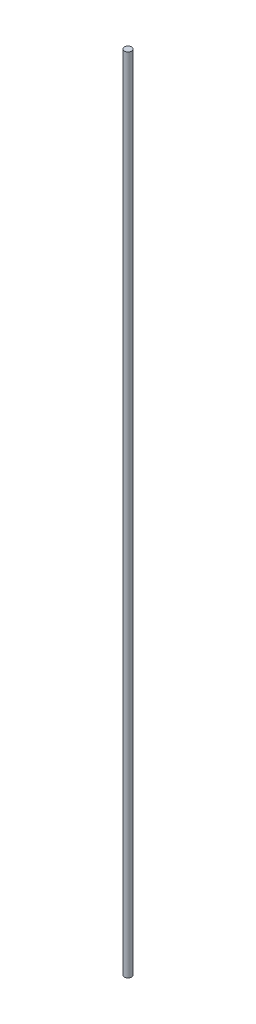
ISO-10303-21;
HEADER;
FILE_DESCRIPTION(('STEP AP214'),'2;1');
FILE_NAME('part.step','',(''),(''),'','','');
FILE_SCHEMA(('AUTOMOTIVE_DESIGN { 1 0 10303 214 1 1 1 1 }'));
ENDSEC;
DATA;
#1=APPLICATION_CONTEXT('core data for automotive mechanical design processes');
#2=APPLICATION_PROTOCOL_DEFINITION('international standard','automotive_design',2000,#1);
#3=PRODUCT_CONTEXT('',#1,'mechanical');
#4=PRODUCT('Part','Part','',(#3));
#5=PRODUCT_RELATED_PRODUCT_CATEGORY('part','',(#4));
#6=PRODUCT_DEFINITION_FORMATION('','',#4);
#7=PRODUCT_DEFINITION_CONTEXT('part definition',#1,'design');
#8=PRODUCT_DEFINITION('design','',#6,#7);
#9=PRODUCT_DEFINITION_SHAPE('','',#8);
#10=(LENGTH_UNIT() NAMED_UNIT(*) SI_UNIT(.MILLI.,.METRE.));
#11=(NAMED_UNIT(*) PLANE_ANGLE_UNIT() SI_UNIT($,.RADIAN.));
#12=(NAMED_UNIT(*) SI_UNIT($,.STERADIAN.) SOLID_ANGLE_UNIT());
#13=UNCERTAINTY_MEASURE_WITH_UNIT(LENGTH_MEASURE(1.E-05),#10,'distance_accuracy_value','');
#14=(GEOMETRIC_REPRESENTATION_CONTEXT(3) GLOBAL_UNCERTAINTY_ASSIGNED_CONTEXT((#13)) GLOBAL_UNIT_ASSIGNED_CONTEXT((#10,
#11,#12)) REPRESENTATION_CONTEXT('',''));
#15=CARTESIAN_POINT('',(0.,0.,0.));
#16=DIRECTION('',(0.,0.,1.));
#17=DIRECTION('',(1.,0.,0.));
#18=AXIS2_PLACEMENT_3D('',#15,#16,#17);
#19=CARTESIAN_POINT('',(0.,304.8,0.));
#20=DIRECTION('',(0.,-1.,0.));
#21=DIRECTION('',(0.,0.,-1.));
#22=AXIS2_PLACEMENT_3D('',#19,#20,#21);
#23=CYLINDRICAL_SURFACE('',#22,1.397);
#24=CARTESIAN_POINT('',(0.,304.8,0.));
#25=DIRECTION('',(0.,1.,0.));
#26=DIRECTION('',(0.,0.,1.));
#27=AXIS2_PLACEMENT_3D('',#24,#25,#26);
#28=CIRCLE('',#27,1.397);
#29=CARTESIAN_POINT('',(0.,304.8,1.397));
#30=VERTEX_POINT('',#29);
#31=EDGE_CURVE('E10',#30,#30,#28,.T.);
#32=ORIENTED_EDGE('',*,*,#31,.F.);
#33=EDGE_LOOP('',(#32));
#34=FACE_BOUND('',#33,.T.);
#35=CARTESIAN_POINT('',(0.,0.,0.));
#36=DIRECTION('',(0.,1.,0.));
#37=DIRECTION('',(0.,0.,1.));
#38=AXIS2_PLACEMENT_3D('',#35,#36,#37);
#39=CIRCLE('',#38,1.397);
#40=CARTESIAN_POINT('',(0.,0.,1.397));
#41=VERTEX_POINT('',#40);
#42=EDGE_CURVE('E33',#41,#41,#39,.T.);
#43=ORIENTED_EDGE('',*,*,#42,.T.);
#44=EDGE_LOOP('',(#43));
#45=FACE_BOUND('',#44,.T.);
#46=ADVANCED_FACE('F30',(#34,#45),#23,.T.);
#47=CARTESIAN_POINT('',(0.,304.8,0.));
#48=DIRECTION('',(0.,1.,0.));
#49=DIRECTION('',(0.,0.,1.));
#50=AXIS2_PLACEMENT_3D('',#47,#48,#49);
#51=PLANE('',#50);
#52=ORIENTED_EDGE('',*,*,#31,.T.);
#53=EDGE_LOOP('',(#52));
#54=FACE_BOUND('',#53,.T.);
#55=ADVANCED_FACE('F45',(#54),#51,.T.);
#56=CARTESIAN_POINT('',(0.,0.,0.));
#57=DIRECTION('',(0.,1.,0.));
#58=DIRECTION('',(0.,0.,1.));
#59=AXIS2_PLACEMENT_3D('',#56,#57,#58);
#60=PLANE('',#59);
#61=ORIENTED_EDGE('',*,*,#42,.F.);
#62=EDGE_LOOP('',(#61));
#63=FACE_BOUND('',#62,.T.);
#64=ADVANCED_FACE('F43',(#63),#60,.F.);
#65=CLOSED_SHELL('',(#46,#55,#64));
#66=MANIFOLD_SOLID_BREP('B2',#65);
#67=ADVANCED_BREP_SHAPE_REPRESENTATION('',(#18,#66),#14);
#68=SHAPE_DEFINITION_REPRESENTATION(#9,#67);
ENDSEC;
END-ISO-10303-21;
